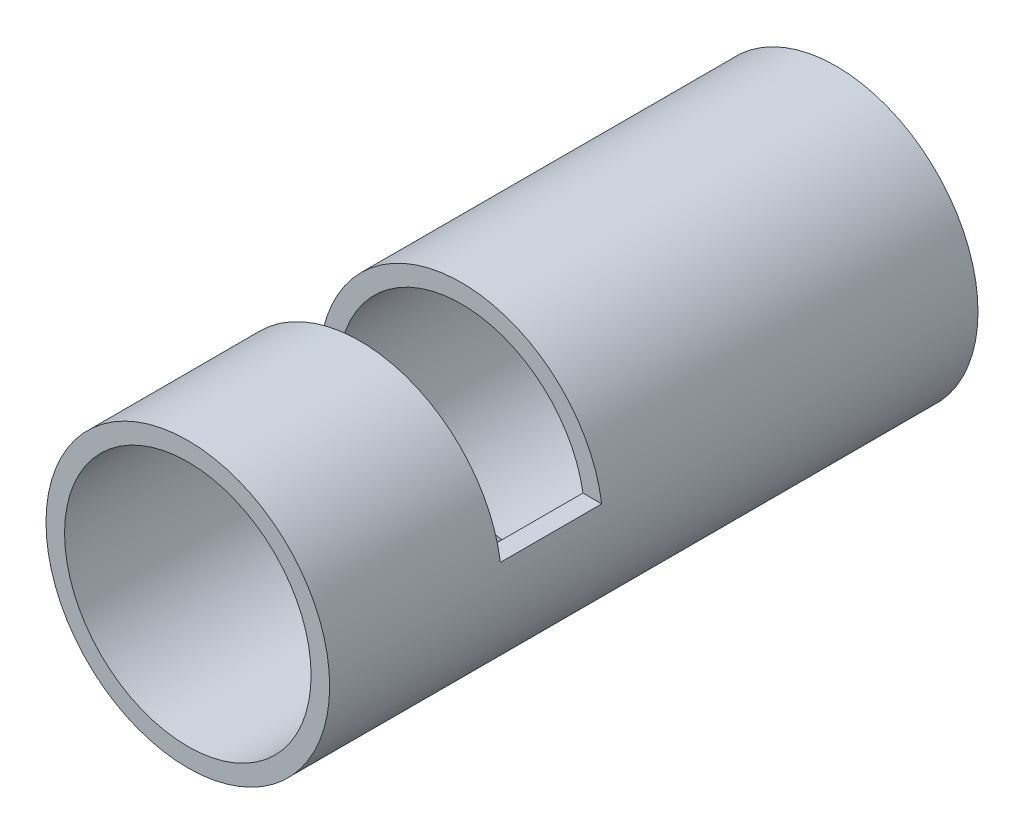
ISO-10303-21;
HEADER;
FILE_DESCRIPTION(('STEP AP214'),'2;1');
FILE_NAME('part.step','',(''),(''),'','','');
FILE_SCHEMA(('AUTOMOTIVE_DESIGN { 1 0 10303 214 1 1 1 1 }'));
ENDSEC;
DATA;
#1=APPLICATION_CONTEXT('core data for automotive mechanical design processes');
#2=APPLICATION_PROTOCOL_DEFINITION('international standard','automotive_design',2000,#1);
#3=PRODUCT_CONTEXT('',#1,'mechanical');
#4=PRODUCT('Part','Part','',(#3));
#5=PRODUCT_RELATED_PRODUCT_CATEGORY('part','',(#4));
#6=PRODUCT_DEFINITION_FORMATION('','',#4);
#7=PRODUCT_DEFINITION_CONTEXT('part definition',#1,'design');
#8=PRODUCT_DEFINITION('design','',#6,#7);
#9=PRODUCT_DEFINITION_SHAPE('','',#8);
#10=(LENGTH_UNIT() NAMED_UNIT(*) SI_UNIT(.MILLI.,.METRE.));
#11=(NAMED_UNIT(*) PLANE_ANGLE_UNIT() SI_UNIT($,.RADIAN.));
#12=(NAMED_UNIT(*) SI_UNIT($,.STERADIAN.) SOLID_ANGLE_UNIT());
#13=UNCERTAINTY_MEASURE_WITH_UNIT(LENGTH_MEASURE(1.E-05),#10,'distance_accuracy_value','');
#14=(GEOMETRIC_REPRESENTATION_CONTEXT(3) GLOBAL_UNCERTAINTY_ASSIGNED_CONTEXT((#13)) GLOBAL_UNIT_ASSIGNED_CONTEXT((#10,
#11,#12)) REPRESENTATION_CONTEXT('',''));
#15=CARTESIAN_POINT('',(0.,0.,0.));
#16=DIRECTION('',(0.,0.,1.));
#17=DIRECTION('',(1.,0.,0.));
#18=AXIS2_PLACEMENT_3D('',#15,#16,#17);
#19=CARTESIAN_POINT('',(0.,0.,203.2));
#20=DIRECTION('',(0.,0.,-1.));
#21=DIRECTION('',(-1.,0.,0.));
#22=AXIS2_PLACEMENT_3D('',#19,#20,#21);
#23=CYLINDRICAL_SURFACE('',#22,44.45);
#24=DIRECTION('',(0.,0.,-1.));
#25=VECTOR('',#24,1.);
#26=CARTESIAN_POINT('',(43.9940905122495,6.35000000000001,203.2));
#27=LINE('',#26,#25);
#28=CARTESIAN_POINT('',(43.9940905122495,6.35000000000001,117.475));
#29=VERTEX_POINT('',#28);
#30=CARTESIAN_POINT('',(43.9940905122495,6.35000000000001,149.225));
#31=VERTEX_POINT('',#30);
#32=EDGE_CURVE('E142',#29,#31,#27,.F.);
#33=ORIENTED_EDGE('',*,*,#32,.T.);
#34=CARTESIAN_POINT('',(0.,0.,149.225));
#35=DIRECTION('',(0.,0.,1.));
#36=DIRECTION('',(1.,0.,0.));
#37=AXIS2_PLACEMENT_3D('',#34,#35,#36);
#38=CIRCLE('',#37,44.45);
#39=CARTESIAN_POINT('',(-43.9940905122495,6.35000000000001,149.225));
#40=VERTEX_POINT('',#39);
#41=EDGE_CURVE('E145',#31,#40,#38,.T.);
#42=ORIENTED_EDGE('',*,*,#41,.T.);
#43=DIRECTION('',(0.,0.,-1.));
#44=VECTOR('',#43,1.);
#45=CARTESIAN_POINT('',(-43.9940905122495,6.35000000000001,203.2));
#46=LINE('',#45,#44);
#47=CARTESIAN_POINT('',(-43.9940905122495,6.35000000000001,117.475));
#48=VERTEX_POINT('',#47);
#49=EDGE_CURVE('E139',#40,#48,#46,.T.);
#50=ORIENTED_EDGE('',*,*,#49,.T.);
#51=CARTESIAN_POINT('',(0.,0.,117.475));
#52=DIRECTION('',(0.,0.,1.));
#53=DIRECTION('',(1.,0.,0.));
#54=AXIS2_PLACEMENT_3D('',#51,#52,#53);
#55=CIRCLE('',#54,44.45);
#56=EDGE_CURVE('E135',#29,#48,#55,.T.);
#57=ORIENTED_EDGE('',*,*,#56,.F.);
#58=EDGE_LOOP('',(#33,#42,#50,#57));
#59=FACE_BOUND('',#58,.T.);
#60=CARTESIAN_POINT('',(0.,0.,203.2));
#61=DIRECTION('',(0.,0.,1.));
#62=DIRECTION('',(1.,0.,0.));
#63=AXIS2_PLACEMENT_3D('',#60,#61,#62);
#64=CIRCLE('',#63,44.45);
#65=CARTESIAN_POINT('',(44.45,0.,203.2));
#66=VERTEX_POINT('',#65);
#67=EDGE_CURVE('E125',#66,#66,#64,.T.);
#68=ORIENTED_EDGE('',*,*,#67,.F.);
#69=EDGE_LOOP('',(#68));
#70=FACE_BOUND('',#69,.T.);
#71=CARTESIAN_POINT('',(0.,0.,0.));
#72=DIRECTION('',(0.,0.,1.));
#73=DIRECTION('',(1.,0.,0.));
#74=AXIS2_PLACEMENT_3D('',#71,#72,#73);
#75=CIRCLE('',#74,44.45);
#76=CARTESIAN_POINT('',(44.45,0.,0.));
#77=VERTEX_POINT('',#76);
#78=EDGE_CURVE('E126',#77,#77,#75,.T.);
#79=ORIENTED_EDGE('',*,*,#78,.T.);
#80=EDGE_LOOP('',(#79));
#81=FACE_BOUND('',#80,.T.);
#82=CARTESIAN_POINT('',(0.,0.,136.525));
#83=DIRECTION('',(0.,0.,-1.));
#84=DIRECTION('',(-1.,0.,0.));
#85=AXIS2_PLACEMENT_3D('',#82,#83,#84);
#86=CIRCLE('',#85,44.45);
#87=CARTESIAN_POINT('',(31.1085197333464,-31.75,136.525));
#88=VERTEX_POINT('',#87);
#89=CARTESIAN_POINT('',(-31.1085197333464,-31.75,136.525));
#90=VERTEX_POINT('',#89);
#91=EDGE_CURVE('E152',#88,#90,#86,.T.);
#92=ORIENTED_EDGE('',*,*,#91,.F.);
#93=DIRECTION('',(0.,0.,-1.));
#94=VECTOR('',#93,1.);
#95=CARTESIAN_POINT('',(31.1085197333464,-31.75,203.2));
#96=LINE('',#95,#94);
#97=CARTESIAN_POINT('',(31.1085197333464,-31.75,98.425));
#98=VERTEX_POINT('',#97);
#99=EDGE_CURVE('E158',#98,#88,#96,.F.);
#100=ORIENTED_EDGE('',*,*,#99,.F.);
#101=CARTESIAN_POINT('',(0.,0.,98.425));
#102=DIRECTION('',(0.,0.,-1.));
#103=DIRECTION('',(-1.,0.,0.));
#104=AXIS2_PLACEMENT_3D('',#101,#102,#103);
#105=CIRCLE('',#104,44.45);
#106=CARTESIAN_POINT('',(-31.1085197333464,-31.75,98.425));
#107=VERTEX_POINT('',#106);
#108=EDGE_CURVE('E46',#98,#107,#105,.T.);
#109=ORIENTED_EDGE('',*,*,#108,.T.);
#110=DIRECTION('',(0.,0.,-1.));
#111=VECTOR('',#110,1.);
#112=CARTESIAN_POINT('',(-31.1085197333464,-31.75,203.2));
#113=LINE('',#112,#111);
#114=EDGE_CURVE('E110',#90,#107,#113,.T.);
#115=ORIENTED_EDGE('',*,*,#114,.F.);
#116=EDGE_LOOP('',(#92,#100,#109,#115));
#117=FACE_BOUND('',#116,.T.);
#118=ADVANCED_FACE('F32',(#59,#70,#81,#117),#23,.T.);
#119=CARTESIAN_POINT('',(0.,0.,203.2));
#120=DIRECTION('',(0.,0.,-1.));
#121=DIRECTION('',(-1.,0.,0.));
#122=AXIS2_PLACEMENT_3D('',#119,#120,#121);
#123=CYLINDRICAL_SURFACE('',#122,38.6334);
#124=CARTESIAN_POINT('',(0.,0.,203.2));
#125=DIRECTION('',(0.,0.,1.));
#126=DIRECTION('',(1.,0.,0.));
#127=AXIS2_PLACEMENT_3D('',#124,#125,#126);
#128=CIRCLE('',#127,38.6334);
#129=CARTESIAN_POINT('',(38.6334,0.,203.2));
#130=VERTEX_POINT('',#129);
#131=EDGE_CURVE('E129',#130,#130,#128,.T.);
#132=ORIENTED_EDGE('',*,*,#131,.T.);
#133=EDGE_LOOP('',(#132));
#134=FACE_BOUND('',#133,.T.);
#135=CARTESIAN_POINT('',(0.,0.,0.));
#136=DIRECTION('',(0.,0.,1.));
#137=DIRECTION('',(1.,0.,0.));
#138=AXIS2_PLACEMENT_3D('',#135,#136,#137);
#139=CIRCLE('',#138,38.6334);
#140=CARTESIAN_POINT('',(38.6334,0.,0.));
#141=VERTEX_POINT('',#140);
#142=EDGE_CURVE('E132',#141,#141,#139,.T.);
#143=ORIENTED_EDGE('',*,*,#142,.F.);
#144=EDGE_LOOP('',(#143));
#145=FACE_BOUND('',#144,.T.);
#146=DIRECTION('',(0.,0.,-1.));
#147=VECTOR('',#146,1.);
#148=CARTESIAN_POINT('',(38.1079663004994,6.35000000000001,203.2));
#149=LINE('',#148,#147);
#150=CARTESIAN_POINT('',(38.1079663004994,6.35000000000001,117.475));
#151=VERTEX_POINT('',#150);
#152=CARTESIAN_POINT('',(38.1079663004994,6.35000000000001,149.225));
#153=VERTEX_POINT('',#152);
#154=EDGE_CURVE('E120',#151,#153,#149,.F.);
#155=ORIENTED_EDGE('',*,*,#154,.F.);
#156=CARTESIAN_POINT('',(0.,0.,117.475));
#157=DIRECTION('',(0.,0.,1.));
#158=DIRECTION('',(1.,0.,0.));
#159=AXIS2_PLACEMENT_3D('',#156,#157,#158);
#160=CIRCLE('',#159,38.6334);
#161=CARTESIAN_POINT('',(-38.1079663004994,6.35000000000001,117.475));
#162=VERTEX_POINT('',#161);
#163=EDGE_CURVE('E104',#151,#162,#160,.T.);
#164=ORIENTED_EDGE('',*,*,#163,.T.);
#165=DIRECTION('',(0.,0.,-1.));
#166=VECTOR('',#165,1.);
#167=CARTESIAN_POINT('',(-38.1079663004994,6.35000000000001,203.2));
#168=LINE('',#167,#166);
#169=CARTESIAN_POINT('',(-38.1079663004994,6.35000000000001,149.225));
#170=VERTEX_POINT('',#169);
#171=EDGE_CURVE('E118',#170,#162,#168,.T.);
#172=ORIENTED_EDGE('',*,*,#171,.F.);
#173=CARTESIAN_POINT('',(0.,0.,149.225));
#174=DIRECTION('',(0.,0.,1.));
#175=DIRECTION('',(1.,0.,0.));
#176=AXIS2_PLACEMENT_3D('',#173,#174,#175);
#177=CIRCLE('',#176,38.6334);
#178=EDGE_CURVE('E123',#153,#170,#177,.T.);
#179=ORIENTED_EDGE('',*,*,#178,.F.);
#180=EDGE_LOOP('',(#155,#164,#172,#179));
#181=FACE_BOUND('',#180,.T.);
#182=DIRECTION('',(0.,0.,-1.));
#183=VECTOR('',#182,1.);
#184=CARTESIAN_POINT('',(22.0108404101252,-31.75,203.2));
#185=LINE('',#184,#183);
#186=CARTESIAN_POINT('',(22.0108404101252,-31.75,98.425));
#187=VERTEX_POINT('',#186);
#188=CARTESIAN_POINT('',(22.0108404101252,-31.75,136.525));
#189=VERTEX_POINT('',#188);
#190=EDGE_CURVE('E103',#187,#189,#185,.F.);
#191=ORIENTED_EDGE('',*,*,#190,.T.);
#192=CARTESIAN_POINT('',(0.,0.,136.525));
#193=DIRECTION('',(0.,0.,-1.));
#194=DIRECTION('',(-1.,0.,0.));
#195=AXIS2_PLACEMENT_3D('',#192,#193,#194);
#196=CIRCLE('',#195,38.6334);
#197=CARTESIAN_POINT('',(-22.0108404101252,-31.75,136.525));
#198=VERTEX_POINT('',#197);
#199=EDGE_CURVE('E11',#189,#198,#196,.T.);
#200=ORIENTED_EDGE('',*,*,#199,.T.);
#201=DIRECTION('',(0.,0.,-1.));
#202=VECTOR('',#201,1.);
#203=CARTESIAN_POINT('',(-22.0108404101252,-31.75,203.2));
#204=LINE('',#203,#202);
#205=CARTESIAN_POINT('',(-22.0108404101252,-31.75,98.425));
#206=VERTEX_POINT('',#205);
#207=EDGE_CURVE('E39',#198,#206,#204,.T.);
#208=ORIENTED_EDGE('',*,*,#207,.T.);
#209=CARTESIAN_POINT('',(0.,0.,98.425));
#210=DIRECTION('',(0.,0.,-1.));
#211=DIRECTION('',(-1.,0.,0.));
#212=AXIS2_PLACEMENT_3D('',#209,#210,#211);
#213=CIRCLE('',#212,38.6334);
#214=EDGE_CURVE('E95',#187,#206,#213,.T.);
#215=ORIENTED_EDGE('',*,*,#214,.F.);
#216=EDGE_LOOP('',(#191,#200,#208,#215));
#217=FACE_BOUND('',#216,.T.);
#218=ADVANCED_FACE('F113',(#134,#145,#181,#217),#123,.F.);
#219=CARTESIAN_POINT('',(0.,0.,203.2));
#220=DIRECTION('',(0.,0.,1.));
#221=DIRECTION('',(1.,0.,0.));
#222=AXIS2_PLACEMENT_3D('',#219,#220,#221);
#223=PLANE('',#222);
#224=ORIENTED_EDGE('',*,*,#67,.T.);
#225=EDGE_LOOP('',(#224));
#226=FACE_BOUND('',#225,.T.);
#227=ORIENTED_EDGE('',*,*,#131,.F.);
#228=EDGE_LOOP('',(#227));
#229=FACE_BOUND('',#228,.T.);
#230=ADVANCED_FACE('F182',(#226,#229),#223,.T.);
#231=CARTESIAN_POINT('',(0.,0.,0.));
#232=DIRECTION('',(0.,0.,1.));
#233=DIRECTION('',(1.,0.,0.));
#234=AXIS2_PLACEMENT_3D('',#231,#232,#233);
#235=PLANE('',#234);
#236=ORIENTED_EDGE('',*,*,#78,.F.);
#237=EDGE_LOOP('',(#236));
#238=FACE_BOUND('',#237,.T.);
#239=ORIENTED_EDGE('',*,*,#142,.T.);
#240=EDGE_LOOP('',(#239));
#241=FACE_BOUND('',#240,.T.);
#242=ADVANCED_FACE('F191',(#238,#241),#235,.F.);
#243=CARTESIAN_POINT('',(-44.45,0.,117.475));
#244=DIRECTION('',(0.,0.,1.));
#245=DIRECTION('',(1.,0.,0.));
#246=AXIS2_PLACEMENT_3D('',#243,#244,#245);
#247=PLANE('',#246);
#248=ORIENTED_EDGE('',*,*,#56,.T.);
#249=DIRECTION('',(1.,0.,0.));
#250=VECTOR('',#249,1.);
#251=CARTESIAN_POINT('',(-44.45,6.35000000000001,117.475));
#252=LINE('',#251,#250);
#253=EDGE_CURVE('E147',#48,#162,#252,.T.);
#254=ORIENTED_EDGE('',*,*,#253,.T.);
#255=ORIENTED_EDGE('',*,*,#163,.F.);
#256=EDGE_CURVE('E153',#151,#29,#252,.T.);
#257=ORIENTED_EDGE('',*,*,#256,.T.);
#258=EDGE_LOOP('',(#248,#254,#255,#257));
#259=FACE_BOUND('',#258,.T.);
#260=ADVANCED_FACE('F194',(#259),#247,.T.);
#261=CARTESIAN_POINT('',(-44.45,6.35000000000001,0.));
#262=DIRECTION('',(0.,-1.,0.));
#263=DIRECTION('',(0.,0.,-1.));
#264=AXIS2_PLACEMENT_3D('',#261,#262,#263);
#265=PLANE('',#264);
#266=DIRECTION('',(1.,0.,0.));
#267=VECTOR('',#266,1.);
#268=CARTESIAN_POINT('',(-44.45,6.35000000000001,149.225));
#269=LINE('',#268,#267);
#270=EDGE_CURVE('E151',#40,#170,#269,.T.);
#271=ORIENTED_EDGE('',*,*,#270,.T.);
#272=ORIENTED_EDGE('',*,*,#171,.T.);
#273=ORIENTED_EDGE('',*,*,#253,.F.);
#274=ORIENTED_EDGE('',*,*,#49,.F.);
#275=EDGE_LOOP('',(#271,#272,#273,#274));
#276=FACE_BOUND('',#275,.T.);
#277=ADVANCED_FACE('F211',(#276),#265,.F.);
#278=ORIENTED_EDGE('',*,*,#256,.F.);
#279=ORIENTED_EDGE('',*,*,#154,.T.);
#280=EDGE_CURVE('E148',#153,#31,#269,.T.);
#281=ORIENTED_EDGE('',*,*,#280,.T.);
#282=ORIENTED_EDGE('',*,*,#32,.F.);
#283=EDGE_LOOP('',(#278,#279,#281,#282));
#284=FACE_BOUND('',#283,.T.);
#285=ADVANCED_FACE('F203',(#284),#265,.F.);
#286=CARTESIAN_POINT('',(-44.45,0.,149.225));
#287=DIRECTION('',(0.,0.,1.));
#288=DIRECTION('',(1.,0.,0.));
#289=AXIS2_PLACEMENT_3D('',#286,#287,#288);
#290=PLANE('',#289);
#291=ORIENTED_EDGE('',*,*,#280,.F.);
#292=ORIENTED_EDGE('',*,*,#178,.T.);
#293=ORIENTED_EDGE('',*,*,#270,.F.);
#294=ORIENTED_EDGE('',*,*,#41,.F.);
#295=EDGE_LOOP('',(#291,#292,#293,#294));
#296=FACE_BOUND('',#295,.T.);
#297=ADVANCED_FACE('F213',(#296),#290,.F.);
#298=CARTESIAN_POINT('',(-44.45,0.,136.525));
#299=DIRECTION('',(0.,0.,-1.));
#300=DIRECTION('',(-1.,0.,0.));
#301=AXIS2_PLACEMENT_3D('',#298,#299,#300);
#302=PLANE('',#301);
#303=ORIENTED_EDGE('',*,*,#91,.T.);
#304=DIRECTION('',(1.,0.,0.));
#305=VECTOR('',#304,1.);
#306=CARTESIAN_POINT('',(-44.45,-31.75,136.525));
#307=LINE('',#306,#305);
#308=EDGE_CURVE('E160',#90,#198,#307,.T.);
#309=ORIENTED_EDGE('',*,*,#308,.T.);
#310=ORIENTED_EDGE('',*,*,#199,.F.);
#311=EDGE_CURVE('E111',#189,#88,#307,.T.);
#312=ORIENTED_EDGE('',*,*,#311,.T.);
#313=EDGE_LOOP('',(#303,#309,#310,#312));
#314=FACE_BOUND('',#313,.T.);
#315=ADVANCED_FACE('F166',(#314),#302,.T.);
#316=CARTESIAN_POINT('',(-44.45,-31.75,0.));
#317=DIRECTION('',(0.,-1.,0.));
#318=DIRECTION('',(0.,0.,-1.));
#319=AXIS2_PLACEMENT_3D('',#316,#317,#318);
#320=PLANE('',#319);
#321=ORIENTED_EDGE('',*,*,#114,.T.);
#322=DIRECTION('',(1.,0.,0.));
#323=VECTOR('',#322,1.);
#324=CARTESIAN_POINT('',(-44.45,-31.75,98.425));
#325=LINE('',#324,#323);
#326=EDGE_CURVE('E98',#107,#206,#325,.T.);
#327=ORIENTED_EDGE('',*,*,#326,.T.);
#328=ORIENTED_EDGE('',*,*,#207,.F.);
#329=ORIENTED_EDGE('',*,*,#308,.F.);
#330=EDGE_LOOP('',(#321,#327,#328,#329));
#331=FACE_BOUND('',#330,.T.);
#332=ADVANCED_FACE('F107',(#331),#320,.T.);
#333=ORIENTED_EDGE('',*,*,#99,.T.);
#334=ORIENTED_EDGE('',*,*,#311,.F.);
#335=ORIENTED_EDGE('',*,*,#190,.F.);
#336=EDGE_CURVE('E53',#187,#98,#325,.T.);
#337=ORIENTED_EDGE('',*,*,#336,.T.);
#338=EDGE_LOOP('',(#333,#334,#335,#337));
#339=FACE_BOUND('',#338,.T.);
#340=ADVANCED_FACE('F168',(#339),#320,.T.);
#341=CARTESIAN_POINT('',(-44.45,0.,98.425));
#342=DIRECTION('',(0.,0.,-1.));
#343=DIRECTION('',(-1.,0.,0.));
#344=AXIS2_PLACEMENT_3D('',#341,#342,#343);
#345=PLANE('',#344);
#346=ORIENTED_EDGE('',*,*,#336,.F.);
#347=ORIENTED_EDGE('',*,*,#214,.T.);
#348=ORIENTED_EDGE('',*,*,#326,.F.);
#349=ORIENTED_EDGE('',*,*,#108,.F.);
#350=EDGE_LOOP('',(#346,#347,#348,#349));
#351=FACE_BOUND('',#350,.T.);
#352=ADVANCED_FACE('F97',(#351),#345,.F.);
#353=CLOSED_SHELL('',(#118,#218,#230,#242,#260,#277,#285,#297,#315,#332,#340,#352));
#354=MANIFOLD_SOLID_BREP('B2',#353);
#355=ADVANCED_BREP_SHAPE_REPRESENTATION('',(#18,#354),#14);
#356=SHAPE_DEFINITION_REPRESENTATION(#9,#355);
ENDSEC;
END-ISO-10303-21;
